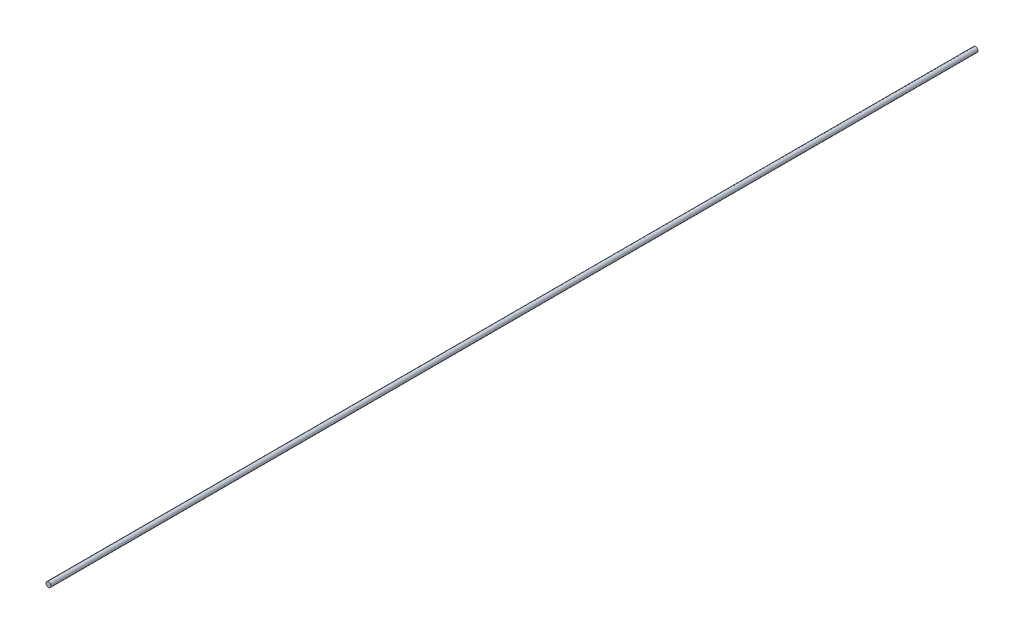
ISO-10303-21;
HEADER;
FILE_DESCRIPTION(('STEP AP214'),'2;1');
FILE_NAME('part.step','',(''),(''),'','','');
FILE_SCHEMA(('AUTOMOTIVE_DESIGN { 1 0 10303 214 1 1 1 1 }'));
ENDSEC;
DATA;
#1=APPLICATION_CONTEXT('core data for automotive mechanical design processes');
#2=APPLICATION_PROTOCOL_DEFINITION('international standard','automotive_design',2000,#1);
#3=PRODUCT_CONTEXT('',#1,'mechanical');
#4=PRODUCT('Part','Part','',(#3));
#5=PRODUCT_RELATED_PRODUCT_CATEGORY('part','',(#4));
#6=PRODUCT_DEFINITION_FORMATION('','',#4);
#7=PRODUCT_DEFINITION_CONTEXT('part definition',#1,'design');
#8=PRODUCT_DEFINITION('design','',#6,#7);
#9=PRODUCT_DEFINITION_SHAPE('','',#8);
#10=(LENGTH_UNIT() NAMED_UNIT(*) SI_UNIT(.MILLI.,.METRE.));
#11=(NAMED_UNIT(*) PLANE_ANGLE_UNIT() SI_UNIT($,.RADIAN.));
#12=(NAMED_UNIT(*) SI_UNIT($,.STERADIAN.) SOLID_ANGLE_UNIT());
#13=UNCERTAINTY_MEASURE_WITH_UNIT(LENGTH_MEASURE(1.E-05),#10,'distance_accuracy_value','');
#14=(GEOMETRIC_REPRESENTATION_CONTEXT(3) GLOBAL_UNCERTAINTY_ASSIGNED_CONTEXT((#13)) GLOBAL_UNIT_ASSIGNED_CONTEXT((#10,
#11,#12)) REPRESENTATION_CONTEXT('',''));
#15=CARTESIAN_POINT('',(0.,0.,0.));
#16=DIRECTION('',(0.,0.,1.));
#17=DIRECTION('',(1.,0.,0.));
#18=AXIS2_PLACEMENT_3D('',#15,#16,#17);
#19=CARTESIAN_POINT('',(0.,0.,685.8));
#20=DIRECTION('',(0.,0.,-1.));
#21=DIRECTION('',(-1.,0.,0.));
#22=AXIS2_PLACEMENT_3D('',#19,#20,#21);
#23=CYLINDRICAL_SURFACE('',#22,1.8161);
#24=CARTESIAN_POINT('',(0.,0.,685.8));
#25=DIRECTION('',(0.,0.,1.));
#26=DIRECTION('',(1.,0.,0.));
#27=AXIS2_PLACEMENT_3D('',#24,#25,#26);
#28=CIRCLE('',#27,1.8161);
#29=CARTESIAN_POINT('',(1.8161,0.,685.8));
#30=VERTEX_POINT('',#29);
#31=EDGE_CURVE('E10',#30,#30,#28,.T.);
#32=ORIENTED_EDGE('',*,*,#31,.F.);
#33=EDGE_LOOP('',(#32));
#34=FACE_BOUND('',#33,.T.);
#35=CARTESIAN_POINT('',(0.,0.,0.));
#36=DIRECTION('',(0.,0.,1.));
#37=DIRECTION('',(1.,0.,0.));
#38=AXIS2_PLACEMENT_3D('',#35,#36,#37);
#39=CIRCLE('',#38,1.8161);
#40=CARTESIAN_POINT('',(1.8161,0.,0.));
#41=VERTEX_POINT('',#40);
#42=EDGE_CURVE('E34',#41,#41,#39,.T.);
#43=ORIENTED_EDGE('',*,*,#42,.T.);
#44=EDGE_LOOP('',(#43));
#45=FACE_BOUND('',#44,.T.);
#46=ADVANCED_FACE('F31',(#34,#45),#23,.T.);
#47=CARTESIAN_POINT('',(0.,0.,685.8));
#48=DIRECTION('',(0.,0.,1.));
#49=DIRECTION('',(1.,0.,0.));
#50=AXIS2_PLACEMENT_3D('',#47,#48,#49);
#51=PLANE('',#50);
#52=ORIENTED_EDGE('',*,*,#31,.T.);
#53=EDGE_LOOP('',(#52));
#54=FACE_BOUND('',#53,.T.);
#55=ADVANCED_FACE('F46',(#54),#51,.T.);
#56=CARTESIAN_POINT('',(0.,0.,0.));
#57=DIRECTION('',(0.,0.,1.));
#58=DIRECTION('',(1.,0.,0.));
#59=AXIS2_PLACEMENT_3D('',#56,#57,#58);
#60=PLANE('',#59);
#61=ORIENTED_EDGE('',*,*,#42,.F.);
#62=EDGE_LOOP('',(#61));
#63=FACE_BOUND('',#62,.T.);
#64=ADVANCED_FACE('F44',(#63),#60,.F.);
#65=CLOSED_SHELL('',(#46,#55,#64));
#66=MANIFOLD_SOLID_BREP('B2',#65);
#67=ADVANCED_BREP_SHAPE_REPRESENTATION('',(#18,#66),#14);
#68=SHAPE_DEFINITION_REPRESENTATION(#9,#67);
ENDSEC;
END-ISO-10303-21;
